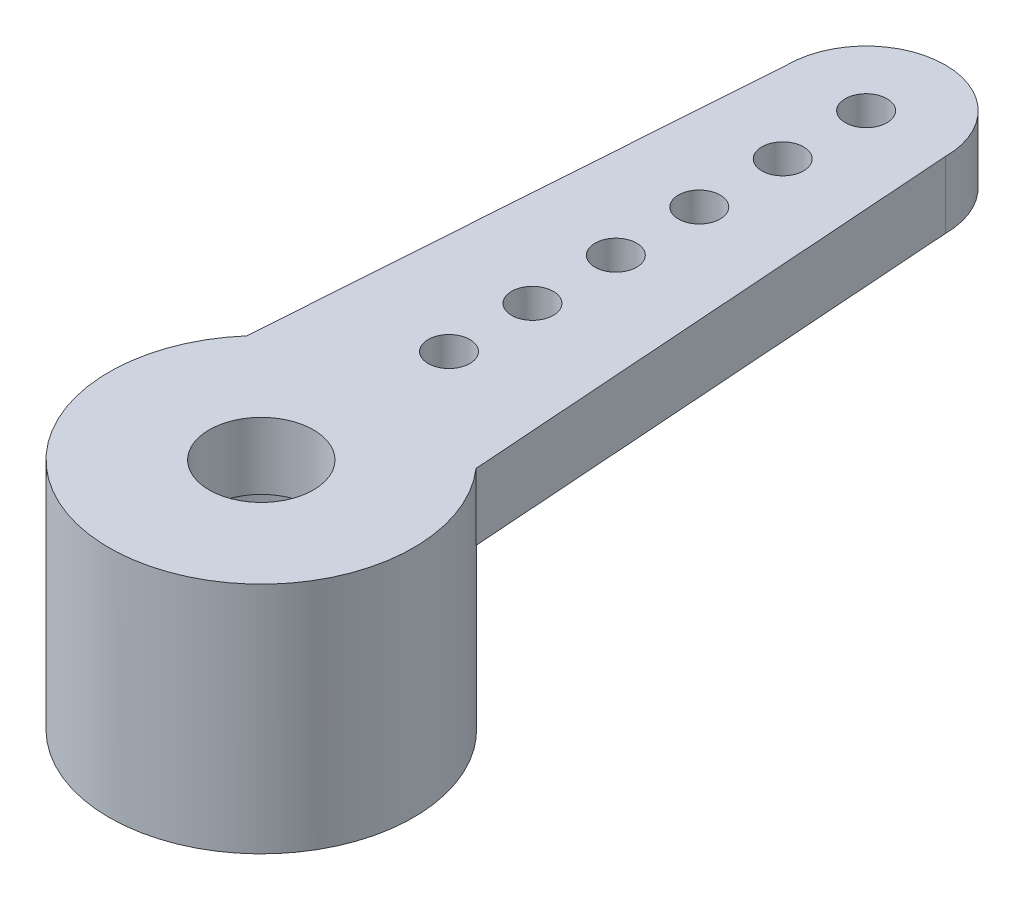
ISO-10303-21;
HEADER;
FILE_DESCRIPTION(('STEP AP214'),'2;1');
FILE_NAME('part.step','',(''),(''),'','','');
FILE_SCHEMA(('AUTOMOTIVE_DESIGN { 1 0 10303 214 1 1 1 1 }'));
ENDSEC;
DATA;
#1=APPLICATION_CONTEXT('core data for automotive mechanical design processes');
#2=APPLICATION_PROTOCOL_DEFINITION('international standard','automotive_design',2000,#1);
#3=PRODUCT_CONTEXT('',#1,'mechanical');
#4=PRODUCT('Part','Part','',(#3));
#5=PRODUCT_RELATED_PRODUCT_CATEGORY('part','',(#4));
#6=PRODUCT_DEFINITION_FORMATION('','',#4);
#7=PRODUCT_DEFINITION_CONTEXT('part definition',#1,'design');
#8=PRODUCT_DEFINITION('design','',#6,#7);
#9=PRODUCT_DEFINITION_SHAPE('','',#8);
#10=(LENGTH_UNIT() NAMED_UNIT(*) SI_UNIT(.MILLI.,.METRE.));
#11=(NAMED_UNIT(*) PLANE_ANGLE_UNIT() SI_UNIT($,.RADIAN.));
#12=(NAMED_UNIT(*) SI_UNIT($,.STERADIAN.) SOLID_ANGLE_UNIT());
#13=UNCERTAINTY_MEASURE_WITH_UNIT(LENGTH_MEASURE(1.E-05),#10,'distance_accuracy_value','');
#14=(GEOMETRIC_REPRESENTATION_CONTEXT(3) GLOBAL_UNCERTAINTY_ASSIGNED_CONTEXT((#13)) GLOBAL_UNIT_ASSIGNED_CONTEXT((#10,
#11,#12)) REPRESENTATION_CONTEXT('',''));
#15=CARTESIAN_POINT('',(0.,0.,0.));
#16=DIRECTION('',(0.,0.,1.));
#17=DIRECTION('',(1.,0.,0.));
#18=AXIS2_PLACEMENT_3D('',#15,#16,#17);
#19=CARTESIAN_POINT('',(0.,0.,0.));
#20=DIRECTION('',(0.,1.,0.));
#21=DIRECTION('',(0.,0.,1.));
#22=AXIS2_PLACEMENT_3D('',#19,#20,#21);
#23=PLANE('',#22);
#24=CARTESIAN_POINT('',(0.,0.,0.));
#25=DIRECTION('',(0.,1.,0.));
#26=DIRECTION('',(0.,0.,1.));
#27=AXIS2_PLACEMENT_3D('',#24,#25,#26);
#28=CIRCLE('',#27,3.65);
#29=CARTESIAN_POINT('',(0.,0.,3.65));
#30=VERTEX_POINT('',#29);
#31=EDGE_CURVE('E37',#30,#30,#28,.T.);
#32=ORIENTED_EDGE('',*,*,#31,.F.);
#33=EDGE_LOOP('',(#32));
#34=FACE_BOUND('',#33,.T.);
#35=CARTESIAN_POINT('',(0.,0.,0.));
#36=DIRECTION('',(0.,1.,0.));
#37=DIRECTION('',(0.,0.,1.));
#38=AXIS2_PLACEMENT_3D('',#35,#36,#37);
#39=CIRCLE('',#38,2.5);
#40=CARTESIAN_POINT('',(0.,0.,2.5));
#41=VERTEX_POINT('',#40);
#42=EDGE_CURVE('E113',#41,#41,#39,.T.);
#43=ORIENTED_EDGE('',*,*,#42,.T.);
#44=EDGE_LOOP('',(#43));
#45=FACE_BOUND('',#44,.T.);
#46=ADVANCED_FACE('F33',(#34,#45),#23,.F.);
#47=CARTESIAN_POINT('',(0.,4.,0.));
#48=DIRECTION('',(0.,-1.,0.));
#49=DIRECTION('',(0.,0.,-1.));
#50=AXIS2_PLACEMENT_3D('',#47,#48,#49);
#51=CYLINDRICAL_SURFACE('',#50,3.65);
#52=CARTESIAN_POINT('',(0.,4.,0.));
#53=DIRECTION('',(0.,1.,0.));
#54=DIRECTION('',(0.,0.,1.));
#55=AXIS2_PLACEMENT_3D('',#52,#53,#54);
#56=CIRCLE('',#55,3.65);
#57=CARTESIAN_POINT('',(2.75,4.,-2.4));
#58=VERTEX_POINT('',#57);
#59=CARTESIAN_POINT('',(-2.75,4.,-2.4));
#60=VERTEX_POINT('',#59);
#61=EDGE_CURVE('E11',#58,#60,#56,.T.);
#62=ORIENTED_EDGE('',*,*,#61,.F.);
#63=DIRECTION('',(0.,-1.,0.));
#64=VECTOR('',#63,1.);
#65=CARTESIAN_POINT('',(2.75,5.6,-2.4));
#66=LINE('',#65,#64);
#67=CARTESIAN_POINT('',(2.75,5.6,-2.4));
#68=VERTEX_POINT('',#67);
#69=EDGE_CURVE('E93',#68,#58,#66,.T.);
#70=ORIENTED_EDGE('',*,*,#69,.F.);
#71=CARTESIAN_POINT('',(0.,5.6,0.));
#72=DIRECTION('',(0.,1.,0.));
#73=DIRECTION('',(0.,0.,1.));
#74=AXIS2_PLACEMENT_3D('',#71,#72,#73);
#75=CIRCLE('',#74,3.65);
#76=CARTESIAN_POINT('',(-2.75,5.6,-2.4));
#77=VERTEX_POINT('',#76);
#78=EDGE_CURVE('E81',#77,#68,#75,.T.);
#79=ORIENTED_EDGE('',*,*,#78,.F.);
#80=DIRECTION('',(0.,-1.,0.));
#81=VECTOR('',#80,1.);
#82=CARTESIAN_POINT('',(-2.75,5.6,-2.4));
#83=LINE('',#82,#81);
#84=EDGE_CURVE('E88',#77,#60,#83,.T.);
#85=ORIENTED_EDGE('',*,*,#84,.T.);
#86=EDGE_LOOP('',(#62,#70,#79,#85));
#87=FACE_BOUND('',#86,.T.);
#88=ORIENTED_EDGE('',*,*,#31,.T.);
#89=EDGE_LOOP('',(#88));
#90=FACE_BOUND('',#89,.T.);
#91=ADVANCED_FACE('F35',(#87,#90),#51,.T.);
#92=CARTESIAN_POINT('',(0.,4.,0.));
#93=DIRECTION('',(0.,-1.,0.));
#94=DIRECTION('',(0.,0.,-1.));
#95=AXIS2_PLACEMENT_3D('',#92,#93,#94);
#96=CYLINDRICAL_SURFACE('',#95,2.5);
#97=CARTESIAN_POINT('',(0.,4.,0.));
#98=DIRECTION('',(0.,1.,0.));
#99=DIRECTION('',(0.,0.,1.));
#100=AXIS2_PLACEMENT_3D('',#97,#98,#99);
#101=CIRCLE('',#100,2.5);
#102=CARTESIAN_POINT('',(0.,4.,2.5));
#103=VERTEX_POINT('',#102);
#104=EDGE_CURVE('E110',#103,#103,#101,.T.);
#105=ORIENTED_EDGE('',*,*,#104,.T.);
#106=EDGE_LOOP('',(#105));
#107=FACE_BOUND('',#106,.T.);
#108=ORIENTED_EDGE('',*,*,#42,.F.);
#109=EDGE_LOOP('',(#108));
#110=FACE_BOUND('',#109,.T.);
#111=ADVANCED_FACE('F124',(#107,#110),#96,.F.);
#112=CARTESIAN_POINT('',(0.,4.,-14.5));
#113=DIRECTION('',(0.,-1.,0.));
#114=DIRECTION('',(0.,0.,-1.));
#115=AXIS2_PLACEMENT_3D('',#112,#113,#114);
#116=PLANE('',#115);
#117=CARTESIAN_POINT('',(0.,4.,0.));
#118=DIRECTION('',(0.,1.,0.));
#119=DIRECTION('',(0.,0.,1.));
#120=AXIS2_PLACEMENT_3D('',#117,#118,#119);
#121=CIRCLE('',#120,1.25);
#122=CARTESIAN_POINT('',(0.,4.,1.25));
#123=VERTEX_POINT('',#122);
#124=EDGE_CURVE('E214',#123,#123,#121,.T.);
#125=ORIENTED_EDGE('',*,*,#124,.T.);
#126=EDGE_LOOP('',(#125));
#127=FACE_BOUND('',#126,.T.);
#128=ORIENTED_EDGE('',*,*,#104,.F.);
#129=EDGE_LOOP('',(#128));
#130=FACE_BOUND('',#129,.T.);
#131=ADVANCED_FACE('F128',(#127,#130),#116,.T.);
#132=CARTESIAN_POINT('',(0.,5.6,-14.5));
#133=DIRECTION('',(0.,-1.,0.));
#134=DIRECTION('',(0.,0.,-1.));
#135=AXIS2_PLACEMENT_3D('',#132,#133,#134);
#136=PLANE('',#135);
#137=CARTESIAN_POINT('',(1.40271576953299E-13,5.6,-4.5));
#138=DIRECTION('',(0.,1.,0.));
#139=DIRECTION('',(0.,0.,1.));
#140=AXIS2_PLACEMENT_3D('',#137,#138,#139);
#141=CIRCLE('',#140,0.5);
#142=CARTESIAN_POINT('',(1.40271576953299E-13,5.6,-4.));
#143=VERTEX_POINT('',#142);
#144=EDGE_CURVE('E196',#143,#143,#141,.T.);
#145=ORIENTED_EDGE('',*,*,#144,.F.);
#146=EDGE_LOOP('',(#145));
#147=FACE_BOUND('',#146,.T.);
#148=CARTESIAN_POINT('',(0.,5.6,-10.5));
#149=DIRECTION('',(0.,1.,0.));
#150=DIRECTION('',(0.,0.,1.));
#151=AXIS2_PLACEMENT_3D('',#148,#149,#150);
#152=CIRCLE('',#151,0.5);
#153=CARTESIAN_POINT('',(0.,5.6,-10.));
#154=VERTEX_POINT('',#153);
#155=EDGE_CURVE('E197',#154,#154,#152,.T.);
#156=ORIENTED_EDGE('',*,*,#155,.F.);
#157=EDGE_LOOP('',(#156));
#158=FACE_BOUND('',#157,.T.);
#159=CARTESIAN_POINT('',(0.,5.6,-8.5));
#160=DIRECTION('',(0.,1.,0.));
#161=DIRECTION('',(0.,0.,1.));
#162=AXIS2_PLACEMENT_3D('',#159,#160,#161);
#163=CIRCLE('',#162,0.5);
#164=CARTESIAN_POINT('',(0.,5.6,-8.));
#165=VERTEX_POINT('',#164);
#166=EDGE_CURVE('E186',#165,#165,#163,.T.);
#167=ORIENTED_EDGE('',*,*,#166,.F.);
#168=EDGE_LOOP('',(#167));
#169=FACE_BOUND('',#168,.T.);
#170=CARTESIAN_POINT('',(1.12217261562639E-13,5.6,-6.5));
#171=DIRECTION('',(0.,1.,0.));
#172=DIRECTION('',(0.,0.,1.));
#173=AXIS2_PLACEMENT_3D('',#170,#171,#172);
#174=CIRCLE('',#173,0.5);
#175=CARTESIAN_POINT('',(1.12217261562639E-13,5.6,-6.));
#176=VERTEX_POINT('',#175);
#177=EDGE_CURVE('E181',#176,#176,#174,.T.);
#178=ORIENTED_EDGE('',*,*,#177,.F.);
#179=EDGE_LOOP('',(#178));
#180=FACE_BOUND('',#179,.T.);
#181=CARTESIAN_POINT('',(0.,5.6,-14.5));
#182=DIRECTION('',(0.,1.,0.));
#183=DIRECTION('',(0.,0.,1.));
#184=AXIS2_PLACEMENT_3D('',#181,#182,#183);
#185=CIRCLE('',#184,0.5);
#186=CARTESIAN_POINT('',(0.,5.6,-14.));
#187=VERTEX_POINT('',#186);
#188=EDGE_CURVE('E188',#187,#187,#185,.T.);
#189=ORIENTED_EDGE('',*,*,#188,.F.);
#190=EDGE_LOOP('',(#189));
#191=FACE_BOUND('',#190,.T.);
#192=CARTESIAN_POINT('',(0.,5.6,-12.5));
#193=DIRECTION('',(0.,1.,0.));
#194=DIRECTION('',(0.,0.,1.));
#195=AXIS2_PLACEMENT_3D('',#192,#193,#194);
#196=CIRCLE('',#195,0.5);
#197=CARTESIAN_POINT('',(0.,5.6,-12.));
#198=VERTEX_POINT('',#197);
#199=EDGE_CURVE('E211',#198,#198,#196,.T.);
#200=ORIENTED_EDGE('',*,*,#199,.F.);
#201=EDGE_LOOP('',(#200));
#202=FACE_BOUND('',#201,.T.);
#203=CARTESIAN_POINT('',(0.,5.6,-14.5));
#204=DIRECTION('',(0.,1.,0.));
#205=DIRECTION('',(0.,0.,-1.));
#206=AXIS2_PLACEMENT_3D('',#203,#204,#205);
#207=CIRCLE('',#206,1.9);
#208=CARTESIAN_POINT('',(1.9,5.6,-14.5));
#209=VERTEX_POINT('',#208);
#210=CARTESIAN_POINT('',(-1.9,5.6,-14.5));
#211=VERTEX_POINT('',#210);
#212=EDGE_CURVE('E84',#209,#211,#207,.T.);
#213=ORIENTED_EDGE('',*,*,#212,.T.);
#214=DIRECTION('',(-0.0700752439849509,0.,0.997541708491655));
#215=VECTOR('',#214,1.);
#216=CARTESIAN_POINT('',(-2.75,5.6,-2.4));
#217=LINE('',#216,#215);
#218=EDGE_CURVE('E77',#211,#77,#217,.T.);
#219=ORIENTED_EDGE('',*,*,#218,.T.);
#220=ORIENTED_EDGE('',*,*,#78,.T.);
#221=DIRECTION('',(-0.0700752439849509,0.,-0.997541708491655));
#222=VECTOR('',#221,1.);
#223=CARTESIAN_POINT('',(1.9,5.6,-14.5));
#224=LINE('',#223,#222);
#225=EDGE_CURVE('E55',#68,#209,#224,.T.);
#226=ORIENTED_EDGE('',*,*,#225,.T.);
#227=EDGE_LOOP('',(#213,#219,#220,#226));
#228=FACE_BOUND('',#227,.T.);
#229=CARTESIAN_POINT('',(0.,5.6,0.));
#230=DIRECTION('',(0.,1.,0.));
#231=DIRECTION('',(0.,0.,1.));
#232=AXIS2_PLACEMENT_3D('',#229,#230,#231);
#233=CIRCLE('',#232,1.25);
#234=CARTESIAN_POINT('',(0.,5.6,1.25));
#235=VERTEX_POINT('',#234);
#236=EDGE_CURVE('E104',#235,#235,#233,.T.);
#237=ORIENTED_EDGE('',*,*,#236,.F.);
#238=EDGE_LOOP('',(#237));
#239=FACE_BOUND('',#238,.T.);
#240=ADVANCED_FACE('F78',(#147,#158,#169,#180,#191,#202,#228,#239),#136,.F.);
#241=CARTESIAN_POINT('',(1.40271576953299E-13,4.,-4.5));
#242=DIRECTION('',(0.,-1.,0.));
#243=DIRECTION('',(0.,0.,-1.));
#244=AXIS2_PLACEMENT_3D('',#241,#242,#243);
#245=CIRCLE('',#244,0.5);
#246=CARTESIAN_POINT('',(1.40271576953299E-13,4.,-5.));
#247=VERTEX_POINT('',#246);
#248=EDGE_CURVE('E208',#247,#247,#245,.F.);
#249=ORIENTED_EDGE('',*,*,#248,.T.);
#250=EDGE_LOOP('',(#249));
#251=FACE_BOUND('',#250,.T.);
#252=CARTESIAN_POINT('',(0.,4.,-10.5));
#253=DIRECTION('',(0.,-1.,0.));
#254=DIRECTION('',(0.,0.,-1.));
#255=AXIS2_PLACEMENT_3D('',#252,#253,#254);
#256=CIRCLE('',#255,0.5);
#257=CARTESIAN_POINT('',(0.,4.,-11.));
#258=VERTEX_POINT('',#257);
#259=EDGE_CURVE('E201',#258,#258,#256,.F.);
#260=ORIENTED_EDGE('',*,*,#259,.T.);
#261=EDGE_LOOP('',(#260));
#262=FACE_BOUND('',#261,.T.);
#263=CARTESIAN_POINT('',(0.,4.,-8.5));
#264=DIRECTION('',(0.,-1.,0.));
#265=DIRECTION('',(0.,0.,-1.));
#266=AXIS2_PLACEMENT_3D('',#263,#264,#265);
#267=CIRCLE('',#266,0.5);
#268=CARTESIAN_POINT('',(0.,4.,-9.));
#269=VERTEX_POINT('',#268);
#270=EDGE_CURVE('E183',#269,#269,#267,.F.);
#271=ORIENTED_EDGE('',*,*,#270,.T.);
#272=EDGE_LOOP('',(#271));
#273=FACE_BOUND('',#272,.T.);
#274=CARTESIAN_POINT('',(1.12217261562639E-13,4.,-6.5));
#275=DIRECTION('',(0.,-1.,0.));
#276=DIRECTION('',(0.,0.,-1.));
#277=AXIS2_PLACEMENT_3D('',#274,#275,#276);
#278=CIRCLE('',#277,0.5);
#279=CARTESIAN_POINT('',(1.12217261562639E-13,4.,-7.));
#280=VERTEX_POINT('',#279);
#281=EDGE_CURVE('E178',#280,#280,#278,.F.);
#282=ORIENTED_EDGE('',*,*,#281,.T.);
#283=EDGE_LOOP('',(#282));
#284=FACE_BOUND('',#283,.T.);
#285=CARTESIAN_POINT('',(0.,4.,-14.5));
#286=DIRECTION('',(0.,-1.,0.));
#287=DIRECTION('',(0.,0.,-1.));
#288=AXIS2_PLACEMENT_3D('',#285,#286,#287);
#289=CIRCLE('',#288,0.5);
#290=CARTESIAN_POINT('',(0.,4.,-15.));
#291=VERTEX_POINT('',#290);
#292=EDGE_CURVE('E193',#291,#291,#289,.F.);
#293=ORIENTED_EDGE('',*,*,#292,.T.);
#294=EDGE_LOOP('',(#293));
#295=FACE_BOUND('',#294,.T.);
#296=CARTESIAN_POINT('',(0.,4.,-12.5));
#297=DIRECTION('',(0.,-1.,0.));
#298=DIRECTION('',(0.,0.,-1.));
#299=AXIS2_PLACEMENT_3D('',#296,#297,#298);
#300=CIRCLE('',#299,0.5);
#301=CARTESIAN_POINT('',(0.,4.,-13.));
#302=VERTEX_POINT('',#301);
#303=EDGE_CURVE('E200',#302,#302,#300,.F.);
#304=ORIENTED_EDGE('',*,*,#303,.T.);
#305=EDGE_LOOP('',(#304));
#306=FACE_BOUND('',#305,.T.);
#307=DIRECTION('',(-0.0700752439849509,0.,-0.997541708491655));
#308=VECTOR('',#307,1.);
#309=CARTESIAN_POINT('',(1.9,4.,-14.5));
#310=LINE('',#309,#308);
#311=CARTESIAN_POINT('',(1.9,4.,-14.5));
#312=VERTEX_POINT('',#311);
#313=EDGE_CURVE('E69',#58,#312,#310,.T.);
#314=ORIENTED_EDGE('',*,*,#313,.F.);
#315=ORIENTED_EDGE('',*,*,#61,.T.);
#316=DIRECTION('',(-0.0700752439849509,0.,0.997541708491655));
#317=VECTOR('',#316,1.);
#318=CARTESIAN_POINT('',(-2.75,4.,-2.4));
#319=LINE('',#318,#317);
#320=CARTESIAN_POINT('',(-1.9,4.,-14.5));
#321=VERTEX_POINT('',#320);
#322=EDGE_CURVE('E90',#321,#60,#319,.T.);
#323=ORIENTED_EDGE('',*,*,#322,.F.);
#324=CARTESIAN_POINT('',(0.,4.,-14.5));
#325=DIRECTION('',(0.,1.,0.));
#326=DIRECTION('',(0.,0.,-1.));
#327=AXIS2_PLACEMENT_3D('',#324,#325,#326);
#328=CIRCLE('',#327,1.9);
#329=EDGE_CURVE('E101',#312,#321,#328,.T.);
#330=ORIENTED_EDGE('',*,*,#329,.F.);
#331=EDGE_LOOP('',(#314,#315,#323,#330));
#332=FACE_BOUND('',#331,.T.);
#333=ADVANCED_FACE('F133',(#251,#262,#273,#284,#295,#306,#332),#116,.T.);
#334=CARTESIAN_POINT('',(0.,5.6,-14.5));
#335=DIRECTION('',(0.,-1.,0.));
#336=DIRECTION('',(0.,0.,-1.));
#337=AXIS2_PLACEMENT_3D('',#334,#335,#336);
#338=CYLINDRICAL_SURFACE('',#337,1.9);
#339=ORIENTED_EDGE('',*,*,#329,.T.);
#340=DIRECTION('',(0.,-1.,0.));
#341=VECTOR('',#340,1.);
#342=CARTESIAN_POINT('',(-1.9,5.6,-14.5));
#343=LINE('',#342,#341);
#344=EDGE_CURVE('E92',#211,#321,#343,.T.);
#345=ORIENTED_EDGE('',*,*,#344,.F.);
#346=ORIENTED_EDGE('',*,*,#212,.F.);
#347=DIRECTION('',(0.,-1.,0.));
#348=VECTOR('',#347,1.);
#349=CARTESIAN_POINT('',(1.9,5.6,-14.5));
#350=LINE('',#349,#348);
#351=EDGE_CURVE('E97',#209,#312,#350,.T.);
#352=ORIENTED_EDGE('',*,*,#351,.T.);
#353=EDGE_LOOP('',(#339,#345,#346,#352));
#354=FACE_BOUND('',#353,.T.);
#355=ADVANCED_FACE('F130',(#354),#338,.T.);
#356=CARTESIAN_POINT('',(-2.75,5.6,-2.4));
#357=DIRECTION('',(0.997541708491655,0.,0.0700752439849509));
#358=DIRECTION('',(0.070075243984951,0.,-0.997541708491655));
#359=AXIS2_PLACEMENT_3D('',#356,#357,#358);
#360=PLANE('',#359);
#361=ORIENTED_EDGE('',*,*,#322,.T.);
#362=ORIENTED_EDGE('',*,*,#84,.F.);
#363=ORIENTED_EDGE('',*,*,#218,.F.);
#364=ORIENTED_EDGE('',*,*,#344,.T.);
#365=EDGE_LOOP('',(#361,#362,#363,#364));
#366=FACE_BOUND('',#365,.T.);
#367=ADVANCED_FACE('F89',(#366),#360,.F.);
#368=CARTESIAN_POINT('',(1.9,5.6,-14.5));
#369=DIRECTION('',(-0.997541708491655,0.,0.0700752439849509));
#370=DIRECTION('',(0.070075243984951,0.,0.997541708491655));
#371=AXIS2_PLACEMENT_3D('',#368,#369,#370);
#372=PLANE('',#371);
#373=ORIENTED_EDGE('',*,*,#313,.T.);
#374=ORIENTED_EDGE('',*,*,#351,.F.);
#375=ORIENTED_EDGE('',*,*,#225,.F.);
#376=ORIENTED_EDGE('',*,*,#69,.T.);
#377=EDGE_LOOP('',(#373,#374,#375,#376));
#378=FACE_BOUND('',#377,.T.);
#379=ADVANCED_FACE('F137',(#378),#372,.F.);
#380=CARTESIAN_POINT('',(0.,5.6,0.));
#381=DIRECTION('',(0.,-1.,0.));
#382=DIRECTION('',(0.,0.,-1.));
#383=AXIS2_PLACEMENT_3D('',#380,#381,#382);
#384=CYLINDRICAL_SURFACE('',#383,1.25);
#385=ORIENTED_EDGE('',*,*,#236,.T.);
#386=EDGE_LOOP('',(#385));
#387=FACE_BOUND('',#386,.T.);
#388=ORIENTED_EDGE('',*,*,#124,.F.);
#389=EDGE_LOOP('',(#388));
#390=FACE_BOUND('',#389,.T.);
#391=ADVANCED_FACE('F140',(#387,#390),#384,.F.);
#392=CARTESIAN_POINT('',(0.,-0.00100000000000013,-12.5));
#393=DIRECTION('',(0.,1.,0.));
#394=DIRECTION('',(0.,0.,1.));
#395=AXIS2_PLACEMENT_3D('',#392,#393,#394);
#396=CYLINDRICAL_SURFACE('',#395,0.5);
#397=ORIENTED_EDGE('',*,*,#303,.F.);
#398=EDGE_LOOP('',(#397));
#399=FACE_BOUND('',#398,.T.);
#400=ORIENTED_EDGE('',*,*,#199,.T.);
#401=EDGE_LOOP('',(#400));
#402=FACE_BOUND('',#401,.T.);
#403=ADVANCED_FACE('F149',(#399,#402),#396,.F.);
#404=CARTESIAN_POINT('',(0.,-0.00100000000000013,-14.5));
#405=DIRECTION('',(0.,1.,0.));
#406=DIRECTION('',(0.,0.,1.));
#407=AXIS2_PLACEMENT_3D('',#404,#405,#406);
#408=CYLINDRICAL_SURFACE('',#407,0.5);
#409=ORIENTED_EDGE('',*,*,#292,.F.);
#410=EDGE_LOOP('',(#409));
#411=FACE_BOUND('',#410,.T.);
#412=ORIENTED_EDGE('',*,*,#188,.T.);
#413=EDGE_LOOP('',(#412));
#414=FACE_BOUND('',#413,.T.);
#415=ADVANCED_FACE('F153',(#411,#414),#408,.F.);
#416=CARTESIAN_POINT('',(1.12217261562639E-13,-0.00100000000000013,-6.5));
#417=DIRECTION('',(0.,1.,0.));
#418=DIRECTION('',(0.,0.,1.));
#419=AXIS2_PLACEMENT_3D('',#416,#417,#418);
#420=CYLINDRICAL_SURFACE('',#419,0.5);
#421=ORIENTED_EDGE('',*,*,#281,.F.);
#422=EDGE_LOOP('',(#421));
#423=FACE_BOUND('',#422,.T.);
#424=ORIENTED_EDGE('',*,*,#177,.T.);
#425=EDGE_LOOP('',(#424));
#426=FACE_BOUND('',#425,.T.);
#427=ADVANCED_FACE('F163',(#423,#426),#420,.F.);
#428=CARTESIAN_POINT('',(0.,-0.00100000000000013,-8.5));
#429=DIRECTION('',(0.,1.,0.));
#430=DIRECTION('',(0.,0.,1.));
#431=AXIS2_PLACEMENT_3D('',#428,#429,#430);
#432=CYLINDRICAL_SURFACE('',#431,0.5);
#433=ORIENTED_EDGE('',*,*,#270,.F.);
#434=EDGE_LOOP('',(#433));
#435=FACE_BOUND('',#434,.T.);
#436=ORIENTED_EDGE('',*,*,#166,.T.);
#437=EDGE_LOOP('',(#436));
#438=FACE_BOUND('',#437,.T.);
#439=ADVANCED_FACE('F160',(#435,#438),#432,.F.);
#440=CARTESIAN_POINT('',(0.,-0.00100000000000013,-10.5));
#441=DIRECTION('',(0.,1.,0.));
#442=DIRECTION('',(0.,0.,1.));
#443=AXIS2_PLACEMENT_3D('',#440,#441,#442);
#444=CYLINDRICAL_SURFACE('',#443,0.5);
#445=ORIENTED_EDGE('',*,*,#259,.F.);
#446=EDGE_LOOP('',(#445));
#447=FACE_BOUND('',#446,.T.);
#448=ORIENTED_EDGE('',*,*,#155,.T.);
#449=EDGE_LOOP('',(#448));
#450=FACE_BOUND('',#449,.T.);
#451=ADVANCED_FACE('F158',(#447,#450),#444,.F.);
#452=CARTESIAN_POINT('',(1.40271576953299E-13,-0.00100000000000013,-4.5));
#453=DIRECTION('',(0.,1.,0.));
#454=DIRECTION('',(0.,0.,1.));
#455=AXIS2_PLACEMENT_3D('',#452,#453,#454);
#456=CYLINDRICAL_SURFACE('',#455,0.5);
#457=ORIENTED_EDGE('',*,*,#248,.F.);
#458=EDGE_LOOP('',(#457));
#459=FACE_BOUND('',#458,.T.);
#460=ORIENTED_EDGE('',*,*,#144,.T.);
#461=EDGE_LOOP('',(#460));
#462=FACE_BOUND('',#461,.T.);
#463=ADVANCED_FACE('F155',(#459,#462),#456,.F.);
#464=CLOSED_SHELL('',(#46,#91,#111,#131,#240,#333,#355,#367,#379,#391,#403,#415,#427,#439,#451,#463));
#465=MANIFOLD_SOLID_BREP('B2',#464);
#466=ADVANCED_BREP_SHAPE_REPRESENTATION('',(#18,#465),#14);
#467=SHAPE_DEFINITION_REPRESENTATION(#9,#466);
ENDSEC;
END-ISO-10303-21;
